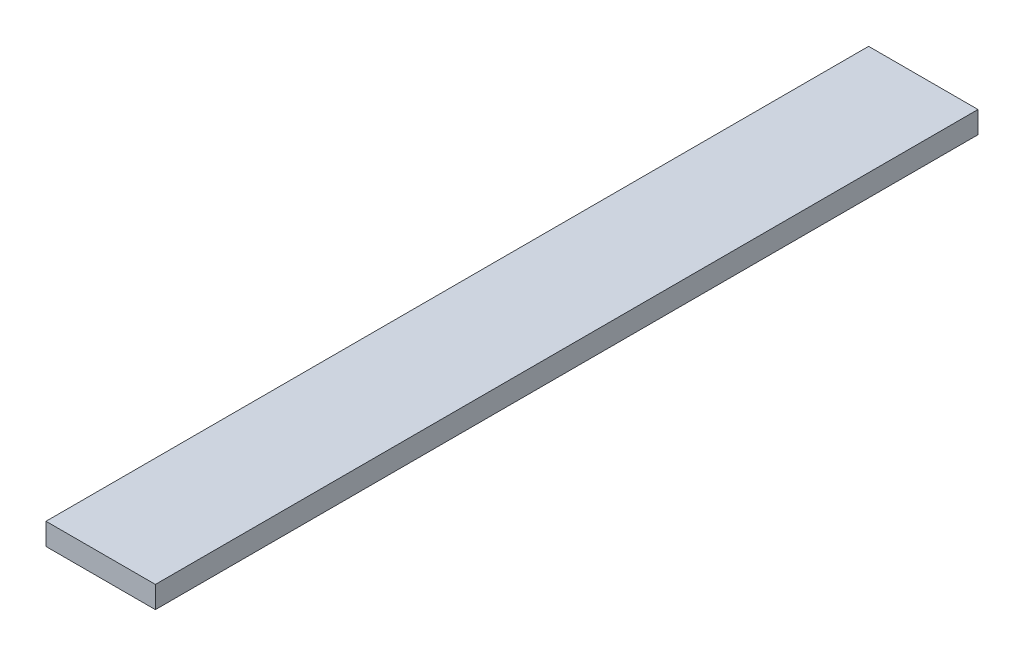
ISO-10303-21;
HEADER;
FILE_DESCRIPTION(('STEP AP214'),'2;1');
FILE_NAME('part.step','',(''),(''),'','','');
FILE_SCHEMA(('AUTOMOTIVE_DESIGN { 1 0 10303 214 1 1 1 1 }'));
ENDSEC;
DATA;
#1=APPLICATION_CONTEXT('core data for automotive mechanical design processes');
#2=APPLICATION_PROTOCOL_DEFINITION('international standard','automotive_design',2000,#1);
#3=PRODUCT_CONTEXT('',#1,'mechanical');
#4=PRODUCT('Part','Part','',(#3));
#5=PRODUCT_RELATED_PRODUCT_CATEGORY('part','',(#4));
#6=PRODUCT_DEFINITION_FORMATION('','',#4);
#7=PRODUCT_DEFINITION_CONTEXT('part definition',#1,'design');
#8=PRODUCT_DEFINITION('design','',#6,#7);
#9=PRODUCT_DEFINITION_SHAPE('','',#8);
#10=(LENGTH_UNIT() NAMED_UNIT(*) SI_UNIT(.MILLI.,.METRE.));
#11=(NAMED_UNIT(*) PLANE_ANGLE_UNIT() SI_UNIT($,.RADIAN.));
#12=(NAMED_UNIT(*) SI_UNIT($,.STERADIAN.) SOLID_ANGLE_UNIT());
#13=UNCERTAINTY_MEASURE_WITH_UNIT(LENGTH_MEASURE(1.E-05),#10,'distance_accuracy_value','');
#14=(GEOMETRIC_REPRESENTATION_CONTEXT(3) GLOBAL_UNCERTAINTY_ASSIGNED_CONTEXT((#13)) GLOBAL_UNIT_ASSIGNED_CONTEXT((#10,
#11,#12)) REPRESENTATION_CONTEXT('',''));
#15=CARTESIAN_POINT('',(0.,0.,0.));
#16=DIRECTION('',(0.,0.,1.));
#17=DIRECTION('',(1.,0.,0.));
#18=AXIS2_PLACEMENT_3D('',#15,#16,#17);
#19=CARTESIAN_POINT('',(0.,1.42999999999,0.));
#20=DIRECTION('',(0.,-1.,0.));
#21=DIRECTION('',(1.,0.,0.));
#22=AXIS2_PLACEMENT_3D('',#19,#20,#21);
#23=PLANE('',#22);
#24=DIRECTION('',(0.,0.,1.));
#25=VECTOR('',#24,1.);
#26=CARTESIAN_POINT('',(0.625,1.42999999999,0.195));
#27=LINE('',#26,#25);
#28=CARTESIAN_POINT('',(0.625,1.42999999999,0.195));
#29=VERTEX_POINT('',#28);
#30=CARTESIAN_POINT('',(0.625,1.42999999999,2.075));
#31=VERTEX_POINT('',#30);
#32=EDGE_CURVE('E80',#29,#31,#27,.T.);
#33=ORIENTED_EDGE('',*,*,#32,.T.);
#34=DIRECTION('',(-1.,0.,0.));
#35=VECTOR('',#34,1.);
#36=CARTESIAN_POINT('',(0.875,1.42999999999,2.075));
#37=LINE('',#36,#35);
#38=CARTESIAN_POINT('',(0.875,1.42999999999,2.075));
#39=VERTEX_POINT('',#38);
#40=EDGE_CURVE('E67',#31,#39,#37,.F.);
#41=ORIENTED_EDGE('',*,*,#40,.T.);
#42=DIRECTION('',(0.,0.,1.));
#43=VECTOR('',#42,1.);
#44=CARTESIAN_POINT('',(0.875,1.42999999999,0.195));
#45=LINE('',#44,#43);
#46=CARTESIAN_POINT('',(0.875,1.42999999999,0.195));
#47=VERTEX_POINT('',#46);
#48=EDGE_CURVE('E54',#39,#47,#45,.F.);
#49=ORIENTED_EDGE('',*,*,#48,.T.);
#50=DIRECTION('',(1.,0.,0.));
#51=VECTOR('',#50,1.);
#52=CARTESIAN_POINT('',(0.875,1.42999999999,0.195));
#53=LINE('',#52,#51);
#54=EDGE_CURVE('E19',#47,#29,#53,.F.);
#55=ORIENTED_EDGE('',*,*,#54,.T.);
#56=EDGE_LOOP('',(#33,#41,#49,#55));
#57=FACE_BOUND('',#56,.T.);
#58=ADVANCED_FACE('F16',(#57),#23,.F.);
#59=CARTESIAN_POINT('',(0.875,1.37999999999,0.195));
#60=DIRECTION('',(0.,0.,1.));
#61=DIRECTION('',(1.,0.,0.));
#62=AXIS2_PLACEMENT_3D('',#59,#60,#61);
#63=PLANE('',#62);
#64=DIRECTION('',(0.,-1.,0.));
#65=VECTOR('',#64,1.);
#66=CARTESIAN_POINT('',(0.875,1.37999999999,0.195));
#67=LINE('',#66,#65);
#68=CARTESIAN_POINT('',(0.875,1.37999999999,0.195));
#69=VERTEX_POINT('',#68);
#70=EDGE_CURVE('E60',#47,#69,#67,.T.);
#71=ORIENTED_EDGE('',*,*,#70,.T.);
#72=DIRECTION('',(1.,0.,0.));
#73=VECTOR('',#72,1.);
#74=CARTESIAN_POINT('',(0.,1.37999999999,0.195));
#75=LINE('',#74,#73);
#76=CARTESIAN_POINT('',(0.625,1.37999999999,0.195));
#77=VERTEX_POINT('',#76);
#78=EDGE_CURVE('E82',#77,#69,#75,.T.);
#79=ORIENTED_EDGE('',*,*,#78,.F.);
#80=DIRECTION('',(0.,1.,0.));
#81=VECTOR('',#80,1.);
#82=CARTESIAN_POINT('',(0.625,1.37999999999,0.195));
#83=LINE('',#82,#81);
#84=EDGE_CURVE('E63',#77,#29,#83,.T.);
#85=ORIENTED_EDGE('',*,*,#84,.T.);
#86=ORIENTED_EDGE('',*,*,#54,.F.);
#87=EDGE_LOOP('',(#71,#79,#85,#86));
#88=FACE_BOUND('',#87,.T.);
#89=ADVANCED_FACE('F59',(#88),#63,.F.);
#90=CARTESIAN_POINT('',(0.875,1.37999999999,0.195));
#91=DIRECTION('',(-1.,0.,0.));
#92=DIRECTION('',(0.,-1.,0.));
#93=AXIS2_PLACEMENT_3D('',#90,#91,#92);
#94=PLANE('',#93);
#95=DIRECTION('',(0.,1.,0.));
#96=VECTOR('',#95,1.);
#97=CARTESIAN_POINT('',(0.875,1.37999999999,2.075));
#98=LINE('',#97,#96);
#99=CARTESIAN_POINT('',(0.875,1.37999999999,2.075));
#100=VERTEX_POINT('',#99);
#101=EDGE_CURVE('E69',#39,#100,#98,.F.);
#102=ORIENTED_EDGE('',*,*,#101,.T.);
#103=DIRECTION('',(0.,0.,1.));
#104=VECTOR('',#103,1.);
#105=CARTESIAN_POINT('',(0.875,1.37999999999,0.));
#106=LINE('',#105,#104);
#107=EDGE_CURVE('E73',#69,#100,#106,.T.);
#108=ORIENTED_EDGE('',*,*,#107,.F.);
#109=ORIENTED_EDGE('',*,*,#70,.F.);
#110=ORIENTED_EDGE('',*,*,#48,.F.);
#111=EDGE_LOOP('',(#102,#108,#109,#110));
#112=FACE_BOUND('',#111,.T.);
#113=ADVANCED_FACE('F71',(#112),#94,.F.);
#114=CARTESIAN_POINT('',(0.875,1.37999999999,2.075));
#115=DIRECTION('',(0.,0.,-1.));
#116=DIRECTION('',(-1.,0.,0.));
#117=AXIS2_PLACEMENT_3D('',#114,#115,#116);
#118=PLANE('',#117);
#119=DIRECTION('',(0.,1.,0.));
#120=VECTOR('',#119,1.);
#121=CARTESIAN_POINT('',(0.625,1.37999999999,2.075));
#122=LINE('',#121,#120);
#123=CARTESIAN_POINT('',(0.625,1.37999999999,2.075));
#124=VERTEX_POINT('',#123);
#125=EDGE_CURVE('E34',#31,#124,#122,.F.);
#126=ORIENTED_EDGE('',*,*,#125,.T.);
#127=DIRECTION('',(1.,0.,0.));
#128=VECTOR('',#127,1.);
#129=CARTESIAN_POINT('',(0.,1.37999999999,2.075));
#130=LINE('',#129,#128);
#131=EDGE_CURVE('E25',#100,#124,#130,.F.);
#132=ORIENTED_EDGE('',*,*,#131,.F.);
#133=ORIENTED_EDGE('',*,*,#101,.F.);
#134=ORIENTED_EDGE('',*,*,#40,.F.);
#135=EDGE_LOOP('',(#126,#132,#133,#134));
#136=FACE_BOUND('',#135,.T.);
#137=ADVANCED_FACE('F88',(#136),#118,.F.);
#138=CARTESIAN_POINT('',(0.625,1.37999999999,0.195));
#139=DIRECTION('',(1.,0.,0.));
#140=DIRECTION('',(0.,1.,0.));
#141=AXIS2_PLACEMENT_3D('',#138,#139,#140);
#142=PLANE('',#141);
#143=ORIENTED_EDGE('',*,*,#84,.F.);
#144=DIRECTION('',(0.,0.,1.));
#145=VECTOR('',#144,1.);
#146=CARTESIAN_POINT('',(0.625,1.37999999999,0.));
#147=LINE('',#146,#145);
#148=EDGE_CURVE('E11',#124,#77,#147,.F.);
#149=ORIENTED_EDGE('',*,*,#148,.F.);
#150=ORIENTED_EDGE('',*,*,#125,.F.);
#151=ORIENTED_EDGE('',*,*,#32,.F.);
#152=EDGE_LOOP('',(#143,#149,#150,#151));
#153=FACE_BOUND('',#152,.T.);
#154=ADVANCED_FACE('F90',(#153),#142,.F.);
#155=CARTESIAN_POINT('',(0.,1.37999999999,0.));
#156=DIRECTION('',(0.,-1.,0.));
#157=DIRECTION('',(1.,0.,0.));
#158=AXIS2_PLACEMENT_3D('',#155,#156,#157);
#159=PLANE('',#158);
#160=ORIENTED_EDGE('',*,*,#131,.T.);
#161=ORIENTED_EDGE('',*,*,#148,.T.);
#162=ORIENTED_EDGE('',*,*,#78,.T.);
#163=ORIENTED_EDGE('',*,*,#107,.T.);
#164=EDGE_LOOP('',(#160,#161,#162,#163));
#165=FACE_BOUND('',#164,.T.);
#166=ADVANCED_FACE('F87',(#165),#159,.T.);
#167=CLOSED_SHELL('',(#58,#89,#113,#137,#154,#166));
#168=MANIFOLD_SOLID_BREP('B1',#167);
#169=ADVANCED_BREP_SHAPE_REPRESENTATION('',(#18,#168),#14);
#170=SHAPE_DEFINITION_REPRESENTATION(#9,#169);
ENDSEC;
END-ISO-10303-21;
